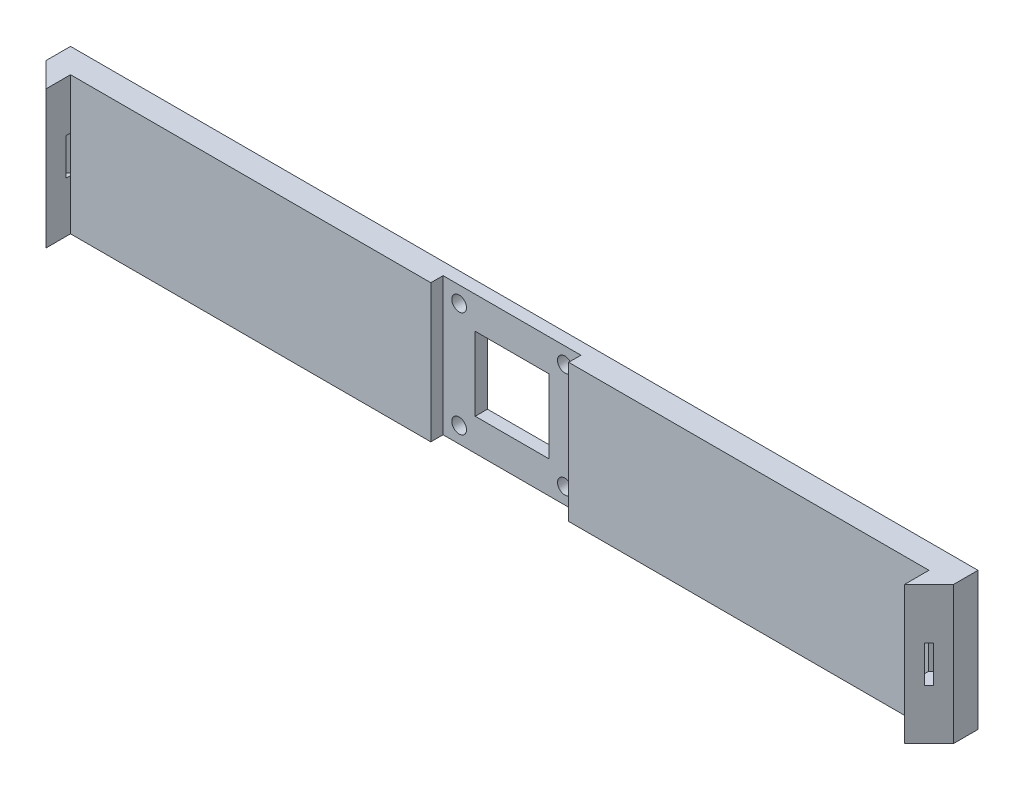
ISO-10303-21;
HEADER;
FILE_DESCRIPTION(('STEP AP214'),'2;1');
FILE_NAME('part.step','',(''),(''),'','','');
FILE_SCHEMA(('AUTOMOTIVE_DESIGN { 1 0 10303 214 1 1 1 1 }'));
ENDSEC;
DATA;
#1=APPLICATION_CONTEXT('core data for automotive mechanical design processes');
#2=APPLICATION_PROTOCOL_DEFINITION('international standard','automotive_design',2000,#1);
#3=PRODUCT_CONTEXT('',#1,'mechanical');
#4=PRODUCT('Part','Part','',(#3));
#5=PRODUCT_RELATED_PRODUCT_CATEGORY('part','',(#4));
#6=PRODUCT_DEFINITION_FORMATION('','',#4);
#7=PRODUCT_DEFINITION_CONTEXT('part definition',#1,'design');
#8=PRODUCT_DEFINITION('design','',#6,#7);
#9=PRODUCT_DEFINITION_SHAPE('','',#8);
#10=(LENGTH_UNIT() NAMED_UNIT(*) SI_UNIT(.MILLI.,.METRE.));
#11=(NAMED_UNIT(*) PLANE_ANGLE_UNIT() SI_UNIT($,.RADIAN.));
#12=(NAMED_UNIT(*) SI_UNIT($,.STERADIAN.) SOLID_ANGLE_UNIT());
#13=UNCERTAINTY_MEASURE_WITH_UNIT(LENGTH_MEASURE(1.E-05),#10,'distance_accuracy_value','');
#14=(GEOMETRIC_REPRESENTATION_CONTEXT(3) GLOBAL_UNCERTAINTY_ASSIGNED_CONTEXT((#13)) GLOBAL_UNIT_ASSIGNED_CONTEXT((#10,
#11,#12)) REPRESENTATION_CONTEXT('',''));
#15=CARTESIAN_POINT('',(0.,0.,0.));
#16=DIRECTION('',(0.,0.,1.));
#17=DIRECTION('',(1.,0.,0.));
#18=AXIS2_PLACEMENT_3D('',#15,#16,#17);
#19=CARTESIAN_POINT('',(0.,0.,10.));
#20=DIRECTION('',(0.,0.,-1.));
#21=DIRECTION('',(-1.,0.,0.));
#22=AXIS2_PLACEMENT_3D('',#19,#20,#21);
#23=PLANE('',#22);
#24=DIRECTION('',(0.,1.,0.));
#25=VECTOR('',#24,1.);
#26=CARTESIAN_POINT('',(-175.,-28.1,10.));
#27=LINE('',#26,#25);
#28=CARTESIAN_POINT('',(-175.,-28.1,10.));
#29=VERTEX_POINT('',#28);
#30=CARTESIAN_POINT('',(-175.,28.1,10.));
#31=VERTEX_POINT('',#30);
#32=EDGE_CURVE('E406',#29,#31,#27,.T.);
#33=ORIENTED_EDGE('',*,*,#32,.F.);
#34=DIRECTION('',(1.,0.,0.));
#35=VECTOR('',#34,1.);
#36=CARTESIAN_POINT('',(-175.,-28.1,10.));
#37=LINE('',#36,#35);
#38=CARTESIAN_POINT('',(-28.1,-28.1,10.));
#39=VERTEX_POINT('',#38);
#40=EDGE_CURVE('E508',#29,#39,#37,.T.);
#41=ORIENTED_EDGE('',*,*,#40,.T.);
#42=DIRECTION('',(0.,-1.,0.));
#43=VECTOR('',#42,1.);
#44=CARTESIAN_POINT('',(-28.1,-28.1,10.));
#45=LINE('',#44,#43);
#46=CARTESIAN_POINT('',(-28.1,28.1,10.));
#47=VERTEX_POINT('',#46);
#48=EDGE_CURVE('E470',#47,#39,#45,.T.);
#49=ORIENTED_EDGE('',*,*,#48,.F.);
#50=DIRECTION('',(-1.,0.,0.));
#51=VECTOR('',#50,1.);
#52=CARTESIAN_POINT('',(-175.,28.1,10.));
#53=LINE('',#52,#51);
#54=EDGE_CURVE('E507',#47,#31,#53,.T.);
#55=ORIENTED_EDGE('',*,*,#54,.T.);
#56=EDGE_LOOP('',(#33,#41,#49,#55));
#57=FACE_BOUND('',#56,.T.);
#58=ADVANCED_FACE('F39',(#57),#23,.F.);
#59=DIRECTION('',(0.,-1.,0.));
#60=VECTOR('',#59,1.);
#61=CARTESIAN_POINT('',(175.,28.1,10.));
#62=LINE('',#61,#60);
#63=CARTESIAN_POINT('',(175.,28.1,10.));
#64=VERTEX_POINT('',#63);
#65=CARTESIAN_POINT('',(175.,-28.1,10.));
#66=VERTEX_POINT('',#65);
#67=EDGE_CURVE('E440',#64,#66,#62,.T.);
#68=ORIENTED_EDGE('',*,*,#67,.F.);
#69=CARTESIAN_POINT('',(28.1,28.1,10.));
#70=VERTEX_POINT('',#69);
#71=EDGE_CURVE('E503',#64,#70,#53,.T.);
#72=ORIENTED_EDGE('',*,*,#71,.T.);
#73=DIRECTION('',(0.,1.,0.));
#74=VECTOR('',#73,1.);
#75=CARTESIAN_POINT('',(28.1,-28.1,10.));
#76=LINE('',#75,#74);
#77=CARTESIAN_POINT('',(28.1,-28.1,10.));
#78=VERTEX_POINT('',#77);
#79=EDGE_CURVE('E464',#78,#70,#76,.T.);
#80=ORIENTED_EDGE('',*,*,#79,.F.);
#81=EDGE_CURVE('E506',#78,#66,#37,.T.);
#82=ORIENTED_EDGE('',*,*,#81,.T.);
#83=EDGE_LOOP('',(#68,#72,#80,#82));
#84=FACE_BOUND('',#83,.T.);
#85=ADVANCED_FACE('F557',(#84),#23,.F.);
#86=CARTESIAN_POINT('',(-175.,28.1,10.));
#87=DIRECTION('',(0.,-1.,0.));
#88=DIRECTION('',(0.,0.,-1.));
#89=AXIS2_PLACEMENT_3D('',#86,#87,#88);
#90=PLANE('',#89);
#91=DIRECTION('',(0.,0.,-1.));
#92=VECTOR('',#91,1.);
#93=CARTESIAN_POINT('',(-185.,28.1,0.));
#94=LINE('',#93,#92);
#95=CARTESIAN_POINT('',(-185.,28.1,10.));
#96=VERTEX_POINT('',#95);
#97=CARTESIAN_POINT('',(-185.,28.1,0.));
#98=VERTEX_POINT('',#97);
#99=EDGE_CURVE('E427',#96,#98,#94,.T.);
#100=ORIENTED_EDGE('',*,*,#99,.F.);
#101=DIRECTION('',(-0.707106781186548,0.,-0.707106781186547));
#102=VECTOR('',#101,1.);
#103=CARTESIAN_POINT('',(-175.,28.1,20.));
#104=LINE('',#103,#102);
#105=CARTESIAN_POINT('',(-175.,28.1,20.));
#106=VERTEX_POINT('',#105);
#107=EDGE_CURVE('E386',#106,#96,#104,.T.);
#108=ORIENTED_EDGE('',*,*,#107,.F.);
#109=DIRECTION('',(0.,0.,-1.));
#110=VECTOR('',#109,1.);
#111=CARTESIAN_POINT('',(-175.,28.1,20.));
#112=LINE('',#111,#110);
#113=EDGE_CURVE('E410',#106,#31,#112,.T.);
#114=ORIENTED_EDGE('',*,*,#113,.T.);
#115=ORIENTED_EDGE('',*,*,#54,.F.);
#116=DIRECTION('',(0.,0.,1.));
#117=VECTOR('',#116,1.);
#118=CARTESIAN_POINT('',(-28.1,28.1,5.));
#119=LINE('',#118,#117);
#120=CARTESIAN_POINT('',(-28.1,28.1,5.));
#121=VERTEX_POINT('',#120);
#122=EDGE_CURVE('E497',#121,#47,#119,.T.);
#123=ORIENTED_EDGE('',*,*,#122,.F.);
#124=DIRECTION('',(-1.,0.,0.));
#125=VECTOR('',#124,1.);
#126=CARTESIAN_POINT('',(-28.1,28.1,5.));
#127=LINE('',#126,#125);
#128=CARTESIAN_POINT('',(28.1,28.1,5.));
#129=VERTEX_POINT('',#128);
#130=EDGE_CURVE('E469',#129,#121,#127,.T.);
#131=ORIENTED_EDGE('',*,*,#130,.F.);
#132=DIRECTION('',(0.,0.,1.));
#133=VECTOR('',#132,1.);
#134=CARTESIAN_POINT('',(28.1,28.1,5.));
#135=LINE('',#134,#133);
#136=EDGE_CURVE('E482',#129,#70,#135,.T.);
#137=ORIENTED_EDGE('',*,*,#136,.T.);
#138=ORIENTED_EDGE('',*,*,#71,.F.);
#139=DIRECTION('',(0.,0.,-1.));
#140=VECTOR('',#139,1.);
#141=CARTESIAN_POINT('',(175.,28.1,20.));
#142=LINE('',#141,#140);
#143=CARTESIAN_POINT('',(175.,28.1,20.));
#144=VERTEX_POINT('',#143);
#145=EDGE_CURVE('E450',#144,#64,#142,.T.);
#146=ORIENTED_EDGE('',*,*,#145,.F.);
#147=DIRECTION('',(-0.707106781186548,0.,0.707106781186547));
#148=VECTOR('',#147,1.);
#149=CARTESIAN_POINT('',(175.,28.1,20.));
#150=LINE('',#149,#148);
#151=CARTESIAN_POINT('',(185.,28.1,10.));
#152=VERTEX_POINT('',#151);
#153=EDGE_CURVE('E430',#152,#144,#150,.T.);
#154=ORIENTED_EDGE('',*,*,#153,.F.);
#155=DIRECTION('',(0.,0.,1.));
#156=VECTOR('',#155,1.);
#157=CARTESIAN_POINT('',(185.,28.1,10.));
#158=LINE('',#157,#156);
#159=CARTESIAN_POINT('',(185.,28.1,0.));
#160=VERTEX_POINT('',#159);
#161=EDGE_CURVE('E460',#160,#152,#158,.T.);
#162=ORIENTED_EDGE('',*,*,#161,.F.);
#163=DIRECTION('',(-1.,0.,0.));
#164=VECTOR('',#163,1.);
#165=CARTESIAN_POINT('',(-175.,28.1,0.));
#166=LINE('',#165,#164);
#167=EDGE_CURVE('E492',#160,#98,#166,.T.);
#168=ORIENTED_EDGE('',*,*,#167,.T.);
#169=EDGE_LOOP('',(#100,#108,#114,#115,#123,#131,#137,#138,#146,#154,#162,#168));
#170=FACE_BOUND('',#169,.T.);
#171=ADVANCED_FACE('F41',(#170),#90,.F.);
#172=CARTESIAN_POINT('',(-175.,-28.1,10.));
#173=DIRECTION('',(0.,1.,0.));
#174=DIRECTION('',(0.,0.,1.));
#175=AXIS2_PLACEMENT_3D('',#172,#173,#174);
#176=PLANE('',#175);
#177=DIRECTION('',(0.,0.,-1.));
#178=VECTOR('',#177,1.);
#179=CARTESIAN_POINT('',(-175.,-28.1,20.));
#180=LINE('',#179,#178);
#181=CARTESIAN_POINT('',(-175.,-28.1,20.));
#182=VERTEX_POINT('',#181);
#183=EDGE_CURVE('E416',#182,#29,#180,.T.);
#184=ORIENTED_EDGE('',*,*,#183,.F.);
#185=DIRECTION('',(-0.707106781186548,0.,-0.707106781186547));
#186=VECTOR('',#185,1.);
#187=CARTESIAN_POINT('',(-175.,-28.1,20.));
#188=LINE('',#187,#186);
#189=CARTESIAN_POINT('',(-185.,-28.1,10.));
#190=VERTEX_POINT('',#189);
#191=EDGE_CURVE('E396',#182,#190,#188,.T.);
#192=ORIENTED_EDGE('',*,*,#191,.T.);
#193=DIRECTION('',(0.,0.,1.));
#194=VECTOR('',#193,1.);
#195=CARTESIAN_POINT('',(-185.,-28.1,0.));
#196=LINE('',#195,#194);
#197=CARTESIAN_POINT('',(-185.,-28.1,0.));
#198=VERTEX_POINT('',#197);
#199=EDGE_CURVE('E423',#198,#190,#196,.T.);
#200=ORIENTED_EDGE('',*,*,#199,.F.);
#201=DIRECTION('',(1.,0.,0.));
#202=VECTOR('',#201,1.);
#203=CARTESIAN_POINT('',(-175.,-28.1,0.));
#204=LINE('',#203,#202);
#205=CARTESIAN_POINT('',(185.,-28.1,0.));
#206=VERTEX_POINT('',#205);
#207=EDGE_CURVE('E514',#198,#206,#204,.T.);
#208=ORIENTED_EDGE('',*,*,#207,.T.);
#209=DIRECTION('',(0.,0.,-1.));
#210=VECTOR('',#209,1.);
#211=CARTESIAN_POINT('',(185.,-28.1,10.));
#212=LINE('',#211,#210);
#213=CARTESIAN_POINT('',(185.,-28.1,10.));
#214=VERTEX_POINT('',#213);
#215=EDGE_CURVE('E453',#214,#206,#212,.T.);
#216=ORIENTED_EDGE('',*,*,#215,.F.);
#217=DIRECTION('',(-0.707106781186548,0.,0.707106781186547));
#218=VECTOR('',#217,1.);
#219=CARTESIAN_POINT('',(175.,-28.1,20.));
#220=LINE('',#219,#218);
#221=CARTESIAN_POINT('',(175.,-28.1,20.));
#222=VERTEX_POINT('',#221);
#223=EDGE_CURVE('E431',#214,#222,#220,.T.);
#224=ORIENTED_EDGE('',*,*,#223,.T.);
#225=DIRECTION('',(0.,0.,-1.));
#226=VECTOR('',#225,1.);
#227=CARTESIAN_POINT('',(175.,-28.1,20.));
#228=LINE('',#227,#226);
#229=EDGE_CURVE('E444',#222,#66,#228,.T.);
#230=ORIENTED_EDGE('',*,*,#229,.T.);
#231=ORIENTED_EDGE('',*,*,#81,.F.);
#232=DIRECTION('',(0.,0.,1.));
#233=VECTOR('',#232,1.);
#234=CARTESIAN_POINT('',(28.1,-28.1,5.));
#235=LINE('',#234,#233);
#236=CARTESIAN_POINT('',(28.1,-28.1,5.));
#237=VERTEX_POINT('',#236);
#238=EDGE_CURVE('E489',#237,#78,#235,.T.);
#239=ORIENTED_EDGE('',*,*,#238,.F.);
#240=DIRECTION('',(1.,0.,0.));
#241=VECTOR('',#240,1.);
#242=CARTESIAN_POINT('',(-28.1,-28.1,5.));
#243=LINE('',#242,#241);
#244=CARTESIAN_POINT('',(-28.1,-28.1,5.));
#245=VERTEX_POINT('',#244);
#246=EDGE_CURVE('E478',#245,#237,#243,.T.);
#247=ORIENTED_EDGE('',*,*,#246,.F.);
#248=DIRECTION('',(0.,0.,1.));
#249=VECTOR('',#248,1.);
#250=CARTESIAN_POINT('',(-28.1,-28.1,5.));
#251=LINE('',#250,#249);
#252=EDGE_CURVE('E493',#245,#39,#251,.T.);
#253=ORIENTED_EDGE('',*,*,#252,.T.);
#254=ORIENTED_EDGE('',*,*,#40,.F.);
#255=EDGE_LOOP('',(#184,#192,#200,#208,#216,#224,#230,#231,#239,#247,#253,#254));
#256=FACE_BOUND('',#255,.T.);
#257=ADVANCED_FACE('F571',(#256),#176,.F.);
#258=CARTESIAN_POINT('',(0.,0.,0.));
#259=DIRECTION('',(0.,0.,-1.));
#260=DIRECTION('',(-1.,0.,0.));
#261=AXIS2_PLACEMENT_3D('',#258,#259,#260);
#262=PLANE('',#261);
#263=CARTESIAN_POINT('',(21.55,-21.55,0.));
#264=DIRECTION('',(0.,0.,1.));
#265=DIRECTION('',(1.,0.,0.));
#266=AXIS2_PLACEMENT_3D('',#263,#264,#265);
#267=CIRCLE('',#266,3.);
#268=CARTESIAN_POINT('',(24.55,-21.55,0.));
#269=VERTEX_POINT('',#268);
#270=EDGE_CURVE('E337',#269,#269,#267,.T.);
#271=ORIENTED_EDGE('',*,*,#270,.T.);
#272=EDGE_LOOP('',(#271));
#273=FACE_BOUND('',#272,.T.);
#274=CARTESIAN_POINT('',(-21.55,21.55,0.));
#275=DIRECTION('',(0.,0.,1.));
#276=DIRECTION('',(1.,0.,0.));
#277=AXIS2_PLACEMENT_3D('',#274,#275,#276);
#278=CIRCLE('',#277,3.);
#279=CARTESIAN_POINT('',(-18.55,21.55,0.));
#280=VERTEX_POINT('',#279);
#281=EDGE_CURVE('E329',#280,#280,#278,.T.);
#282=ORIENTED_EDGE('',*,*,#281,.T.);
#283=EDGE_LOOP('',(#282));
#284=FACE_BOUND('',#283,.T.);
#285=CARTESIAN_POINT('',(-21.55,-21.55,0.));
#286=DIRECTION('',(0.,0.,1.));
#287=DIRECTION('',(1.,0.,0.));
#288=AXIS2_PLACEMENT_3D('',#285,#286,#287);
#289=CIRCLE('',#288,3.);
#290=CARTESIAN_POINT('',(-18.55,-21.55,0.));
#291=VERTEX_POINT('',#290);
#292=EDGE_CURVE('E320',#291,#291,#289,.T.);
#293=ORIENTED_EDGE('',*,*,#292,.T.);
#294=EDGE_LOOP('',(#293));
#295=FACE_BOUND('',#294,.T.);
#296=CARTESIAN_POINT('',(21.55,21.55,0.));
#297=DIRECTION('',(0.,0.,1.));
#298=DIRECTION('',(1.,0.,0.));
#299=AXIS2_PLACEMENT_3D('',#296,#297,#298);
#300=CIRCLE('',#299,3.);
#301=CARTESIAN_POINT('',(24.55,21.55,0.));
#302=VERTEX_POINT('',#301);
#303=EDGE_CURVE('E344',#302,#302,#300,.T.);
#304=ORIENTED_EDGE('',*,*,#303,.T.);
#305=EDGE_LOOP('',(#304));
#306=FACE_BOUND('',#305,.T.);
#307=DIRECTION('',(0.,1.,0.));
#308=VECTOR('',#307,1.);
#309=CARTESIAN_POINT('',(15.,-15.,0.));
#310=LINE('',#309,#308);
#311=CARTESIAN_POINT('',(15.,-15.,0.));
#312=VERTEX_POINT('',#311);
#313=CARTESIAN_POINT('',(15.,15.,0.));
#314=VERTEX_POINT('',#313);
#315=EDGE_CURVE('E352',#312,#314,#310,.T.);
#316=ORIENTED_EDGE('',*,*,#315,.T.);
#317=DIRECTION('',(-1.,0.,0.));
#318=VECTOR('',#317,1.);
#319=CARTESIAN_POINT('',(-15.,15.,0.));
#320=LINE('',#319,#318);
#321=CARTESIAN_POINT('',(-15.,15.,0.));
#322=VERTEX_POINT('',#321);
#323=EDGE_CURVE('E356',#314,#322,#320,.T.);
#324=ORIENTED_EDGE('',*,*,#323,.T.);
#325=DIRECTION('',(0.,-1.,0.));
#326=VECTOR('',#325,1.);
#327=CARTESIAN_POINT('',(-15.,-15.,0.));
#328=LINE('',#327,#326);
#329=CARTESIAN_POINT('',(-15.,-15.,0.));
#330=VERTEX_POINT('',#329);
#331=EDGE_CURVE('E361',#322,#330,#328,.T.);
#332=ORIENTED_EDGE('',*,*,#331,.T.);
#333=DIRECTION('',(1.,0.,0.));
#334=VECTOR('',#333,1.);
#335=CARTESIAN_POINT('',(-15.,-15.,0.));
#336=LINE('',#335,#334);
#337=EDGE_CURVE('E365',#330,#312,#336,.T.);
#338=ORIENTED_EDGE('',*,*,#337,.T.);
#339=EDGE_LOOP('',(#316,#324,#332,#338));
#340=FACE_BOUND('',#339,.T.);
#341=ORIENTED_EDGE('',*,*,#167,.F.);
#342=DIRECTION('',(0.,1.,0.));
#343=VECTOR('',#342,1.);
#344=CARTESIAN_POINT('',(185.,28.1,0.));
#345=LINE('',#344,#343);
#346=EDGE_CURVE('E456',#206,#160,#345,.T.);
#347=ORIENTED_EDGE('',*,*,#346,.F.);
#348=ORIENTED_EDGE('',*,*,#207,.F.);
#349=DIRECTION('',(0.,-1.,0.));
#350=VECTOR('',#349,1.);
#351=CARTESIAN_POINT('',(-185.,-28.1,0.));
#352=LINE('',#351,#350);
#353=EDGE_CURVE('E419',#98,#198,#352,.T.);
#354=ORIENTED_EDGE('',*,*,#353,.F.);
#355=EDGE_LOOP('',(#341,#347,#348,#354));
#356=FACE_BOUND('',#355,.T.);
#357=ADVANCED_FACE('F569',(#273,#284,#295,#306,#340,#356),#262,.T.);
#358=CARTESIAN_POINT('',(28.1,-28.1,5.));
#359=DIRECTION('',(1.,0.,0.));
#360=DIRECTION('',(0.,0.,-1.));
#361=AXIS2_PLACEMENT_3D('',#358,#359,#360);
#362=PLANE('',#361);
#363=ORIENTED_EDGE('',*,*,#79,.T.);
#364=ORIENTED_EDGE('',*,*,#136,.F.);
#365=DIRECTION('',(0.,1.,0.));
#366=VECTOR('',#365,1.);
#367=CARTESIAN_POINT('',(28.1,-28.1,5.));
#368=LINE('',#367,#366);
#369=EDGE_CURVE('E465',#237,#129,#368,.T.);
#370=ORIENTED_EDGE('',*,*,#369,.F.);
#371=ORIENTED_EDGE('',*,*,#238,.T.);
#372=EDGE_LOOP('',(#363,#364,#370,#371));
#373=FACE_BOUND('',#372,.T.);
#374=ADVANCED_FACE('F567',(#373),#362,.F.);
#375=CARTESIAN_POINT('',(-28.1,-28.1,5.));
#376=DIRECTION('',(-1.,0.,0.));
#377=DIRECTION('',(0.,0.,1.));
#378=AXIS2_PLACEMENT_3D('',#375,#376,#377);
#379=PLANE('',#378);
#380=ORIENTED_EDGE('',*,*,#48,.T.);
#381=ORIENTED_EDGE('',*,*,#252,.F.);
#382=DIRECTION('',(0.,-1.,0.));
#383=VECTOR('',#382,1.);
#384=CARTESIAN_POINT('',(-28.1,-28.1,5.));
#385=LINE('',#384,#383);
#386=EDGE_CURVE('E474',#121,#245,#385,.T.);
#387=ORIENTED_EDGE('',*,*,#386,.F.);
#388=ORIENTED_EDGE('',*,*,#122,.T.);
#389=EDGE_LOOP('',(#380,#381,#387,#388));
#390=FACE_BOUND('',#389,.T.);
#391=ADVANCED_FACE('F622',(#390),#379,.F.);
#392=CARTESIAN_POINT('',(0.,0.,5.));
#393=DIRECTION('',(0.,0.,-1.));
#394=DIRECTION('',(-1.,0.,0.));
#395=AXIS2_PLACEMENT_3D('',#392,#393,#394);
#396=PLANE('',#395);
#397=CARTESIAN_POINT('',(21.55,-21.55,5.));
#398=DIRECTION('',(0.,0.,1.));
#399=DIRECTION('',(1.,0.,0.));
#400=AXIS2_PLACEMENT_3D('',#397,#398,#399);
#401=CIRCLE('',#400,3.);
#402=CARTESIAN_POINT('',(24.55,-21.55,5.));
#403=VERTEX_POINT('',#402);
#404=EDGE_CURVE('E319',#403,#403,#401,.T.);
#405=ORIENTED_EDGE('',*,*,#404,.F.);
#406=EDGE_LOOP('',(#405));
#407=FACE_BOUND('',#406,.T.);
#408=CARTESIAN_POINT('',(-21.55,21.55,5.));
#409=DIRECTION('',(0.,0.,1.));
#410=DIRECTION('',(1.,0.,0.));
#411=AXIS2_PLACEMENT_3D('',#408,#409,#410);
#412=CIRCLE('',#411,3.);
#413=CARTESIAN_POINT('',(-18.55,21.55,5.));
#414=VERTEX_POINT('',#413);
#415=EDGE_CURVE('E333',#414,#414,#412,.T.);
#416=ORIENTED_EDGE('',*,*,#415,.F.);
#417=EDGE_LOOP('',(#416));
#418=FACE_BOUND('',#417,.T.);
#419=CARTESIAN_POINT('',(-21.55,-21.55,5.));
#420=DIRECTION('',(0.,0.,1.));
#421=DIRECTION('',(1.,0.,0.));
#422=AXIS2_PLACEMENT_3D('',#419,#420,#421);
#423=CIRCLE('',#422,3.);
#424=CARTESIAN_POINT('',(-18.55,-21.55,5.));
#425=VERTEX_POINT('',#424);
#426=EDGE_CURVE('E325',#425,#425,#423,.T.);
#427=ORIENTED_EDGE('',*,*,#426,.F.);
#428=EDGE_LOOP('',(#427));
#429=FACE_BOUND('',#428,.T.);
#430=CARTESIAN_POINT('',(21.55,21.55,5.));
#431=DIRECTION('',(0.,0.,1.));
#432=DIRECTION('',(1.,0.,0.));
#433=AXIS2_PLACEMENT_3D('',#430,#431,#432);
#434=CIRCLE('',#433,3.);
#435=CARTESIAN_POINT('',(24.55,21.55,5.));
#436=VERTEX_POINT('',#435);
#437=EDGE_CURVE('E324',#436,#436,#434,.T.);
#438=ORIENTED_EDGE('',*,*,#437,.F.);
#439=EDGE_LOOP('',(#438));
#440=FACE_BOUND('',#439,.T.);
#441=DIRECTION('',(-1.,0.,0.));
#442=VECTOR('',#441,1.);
#443=CARTESIAN_POINT('',(-15.,15.,5.));
#444=LINE('',#443,#442);
#445=CARTESIAN_POINT('',(15.,15.,5.));
#446=VERTEX_POINT('',#445);
#447=CARTESIAN_POINT('',(-15.,15.,5.));
#448=VERTEX_POINT('',#447);
#449=EDGE_CURVE('E372',#446,#448,#444,.T.);
#450=ORIENTED_EDGE('',*,*,#449,.F.);
#451=DIRECTION('',(0.,1.,0.));
#452=VECTOR('',#451,1.);
#453=CARTESIAN_POINT('',(15.,-15.,5.));
#454=LINE('',#453,#452);
#455=CARTESIAN_POINT('',(15.,-15.,5.));
#456=VERTEX_POINT('',#455);
#457=EDGE_CURVE('E348',#456,#446,#454,.T.);
#458=ORIENTED_EDGE('',*,*,#457,.F.);
#459=DIRECTION('',(1.,0.,0.));
#460=VECTOR('',#459,1.);
#461=CARTESIAN_POINT('',(-15.,-15.,5.));
#462=LINE('',#461,#460);
#463=CARTESIAN_POINT('',(-15.,-15.,5.));
#464=VERTEX_POINT('',#463);
#465=EDGE_CURVE('E357',#464,#456,#462,.T.);
#466=ORIENTED_EDGE('',*,*,#465,.F.);
#467=DIRECTION('',(0.,-1.,0.));
#468=VECTOR('',#467,1.);
#469=CARTESIAN_POINT('',(-15.,-15.,5.));
#470=LINE('',#469,#468);
#471=EDGE_CURVE('E376',#448,#464,#470,.T.);
#472=ORIENTED_EDGE('',*,*,#471,.F.);
#473=EDGE_LOOP('',(#450,#458,#466,#472));
#474=FACE_BOUND('',#473,.T.);
#475=ORIENTED_EDGE('',*,*,#369,.T.);
#476=ORIENTED_EDGE('',*,*,#130,.T.);
#477=ORIENTED_EDGE('',*,*,#386,.T.);
#478=ORIENTED_EDGE('',*,*,#246,.T.);
#479=EDGE_LOOP('',(#475,#476,#477,#478));
#480=FACE_BOUND('',#479,.T.);
#481=ADVANCED_FACE('F615',(#407,#418,#429,#440,#474,#480),#396,.F.);
#482=CARTESIAN_POINT('',(185.,0.,0.));
#483=DIRECTION('',(1.,0.,0.));
#484=DIRECTION('',(0.,0.,-1.));
#485=AXIS2_PLACEMENT_3D('',#482,#483,#484);
#486=PLANE('',#485);
#487=DIRECTION('',(0.,1.,0.));
#488=VECTOR('',#487,1.);
#489=CARTESIAN_POINT('',(185.,-28.1,10.));
#490=LINE('',#489,#488);
#491=EDGE_CURVE('E435',#214,#152,#490,.T.);
#492=ORIENTED_EDGE('',*,*,#491,.F.);
#493=ORIENTED_EDGE('',*,*,#215,.T.);
#494=ORIENTED_EDGE('',*,*,#346,.T.);
#495=ORIENTED_EDGE('',*,*,#161,.T.);
#496=EDGE_LOOP('',(#492,#493,#494,#495));
#497=FACE_BOUND('',#496,.T.);
#498=ADVANCED_FACE('F601',(#497),#486,.T.);
#499=CARTESIAN_POINT('',(175.,28.1,20.));
#500=DIRECTION('',(1.,0.,0.));
#501=DIRECTION('',(0.,0.,-1.));
#502=AXIS2_PLACEMENT_3D('',#499,#500,#501);
#503=PLANE('',#502);
#504=DIRECTION('',(0.,0.,1.));
#505=VECTOR('',#504,1.);
#506=CARTESIAN_POINT('',(175.,7.5,20.));
#507=LINE('',#506,#505);
#508=CARTESIAN_POINT('',(175.,7.5,10.1005050633884));
#509=VERTEX_POINT('',#508);
#510=CARTESIAN_POINT('',(175.,7.5,11.7677669529664));
#511=VERTEX_POINT('',#510);
#512=EDGE_CURVE('E311',#509,#511,#507,.T.);
#513=ORIENTED_EDGE('',*,*,#512,.T.);
#514=DIRECTION('',(0.,-1.,0.));
#515=VECTOR('',#514,1.);
#516=CARTESIAN_POINT('',(175.,28.1,11.7677669529664));
#517=LINE('',#516,#515);
#518=CARTESIAN_POINT('',(175.,-7.5,11.7677669529664));
#519=VERTEX_POINT('',#518);
#520=EDGE_CURVE('E315',#511,#519,#517,.T.);
#521=ORIENTED_EDGE('',*,*,#520,.T.);
#522=DIRECTION('',(0.,0.,-1.));
#523=VECTOR('',#522,1.);
#524=CARTESIAN_POINT('',(175.,-7.5,20.));
#525=LINE('',#524,#523);
#526=CARTESIAN_POINT('',(175.,-7.5,10.1005050633884));
#527=VERTEX_POINT('',#526);
#528=EDGE_CURVE('E298',#519,#527,#525,.T.);
#529=ORIENTED_EDGE('',*,*,#528,.T.);
#530=DIRECTION('',(0.,-1.,0.));
#531=VECTOR('',#530,1.);
#532=CARTESIAN_POINT('',(175.,28.1,10.1005050633884));
#533=LINE('',#532,#531);
#534=EDGE_CURVE('E48',#509,#527,#533,.T.);
#535=ORIENTED_EDGE('',*,*,#534,.F.);
#536=EDGE_LOOP('',(#513,#521,#529,#535));
#537=FACE_BOUND('',#536,.T.);
#538=ORIENTED_EDGE('',*,*,#67,.T.);
#539=ORIENTED_EDGE('',*,*,#229,.F.);
#540=DIRECTION('',(0.,-1.,0.));
#541=VECTOR('',#540,1.);
#542=CARTESIAN_POINT('',(175.,28.1,20.));
#543=LINE('',#542,#541);
#544=EDGE_CURVE('E441',#144,#222,#543,.T.);
#545=ORIENTED_EDGE('',*,*,#544,.F.);
#546=ORIENTED_EDGE('',*,*,#145,.T.);
#547=EDGE_LOOP('',(#538,#539,#545,#546));
#548=FACE_BOUND('',#547,.T.);
#549=ADVANCED_FACE('F530',(#537,#548),#503,.F.);
#550=CARTESIAN_POINT('',(175.,-28.1,20.));
#551=DIRECTION('',(-0.707106781186547,0.,-0.707106781186548));
#552=DIRECTION('',(-0.707106781186548,0.,0.707106781186547));
#553=AXIS2_PLACEMENT_3D('',#550,#551,#552);
#554=PLANE('',#553);
#555=DIRECTION('',(0.70710678118655,0.,-0.707106781186545));
#556=VECTOR('',#555,1.);
#557=CARTESIAN_POINT('',(180.883883476483,-7.5,14.1161165235168));
#558=LINE('',#557,#556);
#559=CARTESIAN_POINT('',(179.116116523517,-7.5,15.8838834764832));
#560=VERTEX_POINT('',#559);
#561=CARTESIAN_POINT('',(180.883883476483,-7.5,14.1161165235168));
#562=VERTEX_POINT('',#561);
#563=EDGE_CURVE('E284',#560,#562,#558,.T.);
#564=ORIENTED_EDGE('',*,*,#563,.F.);
#565=DIRECTION('',(0.,-1.,0.));
#566=VECTOR('',#565,1.);
#567=CARTESIAN_POINT('',(179.116116523517,-7.5,15.8838834764832));
#568=LINE('',#567,#566);
#569=CARTESIAN_POINT('',(179.116116523517,7.5,15.8838834764832));
#570=VERTEX_POINT('',#569);
#571=EDGE_CURVE('E269',#570,#560,#568,.T.);
#572=ORIENTED_EDGE('',*,*,#571,.F.);
#573=DIRECTION('',(-0.70710678118655,0.,0.707106781186545));
#574=VECTOR('',#573,1.);
#575=CARTESIAN_POINT('',(180.883883476483,7.5,14.1161165235168));
#576=LINE('',#575,#574);
#577=CARTESIAN_POINT('',(180.883883476483,7.5,14.1161165235168));
#578=VERTEX_POINT('',#577);
#579=EDGE_CURVE('E274',#578,#570,#576,.T.);
#580=ORIENTED_EDGE('',*,*,#579,.F.);
#581=DIRECTION('',(0.,1.,0.));
#582=VECTOR('',#581,1.);
#583=CARTESIAN_POINT('',(180.883883476483,-7.5,14.1161165235168));
#584=LINE('',#583,#582);
#585=EDGE_CURVE('E288',#562,#578,#584,.T.);
#586=ORIENTED_EDGE('',*,*,#585,.F.);
#587=EDGE_LOOP('',(#564,#572,#580,#586));
#588=FACE_BOUND('',#587,.T.);
#589=ORIENTED_EDGE('',*,*,#153,.T.);
#590=ORIENTED_EDGE('',*,*,#544,.T.);
#591=ORIENTED_EDGE('',*,*,#223,.F.);
#592=ORIENTED_EDGE('',*,*,#491,.T.);
#593=EDGE_LOOP('',(#589,#590,#591,#592));
#594=FACE_BOUND('',#593,.T.);
#595=ADVANCED_FACE('F542',(#588,#594),#554,.F.);
#596=CARTESIAN_POINT('',(-185.,0.,0.));
#597=DIRECTION('',(1.,0.,0.));
#598=DIRECTION('',(0.,0.,-1.));
#599=AXIS2_PLACEMENT_3D('',#596,#597,#598);
#600=PLANE('',#599);
#601=ORIENTED_EDGE('',*,*,#199,.T.);
#602=DIRECTION('',(0.,1.,0.));
#603=VECTOR('',#602,1.);
#604=CARTESIAN_POINT('',(-185.,-28.1,10.));
#605=LINE('',#604,#603);
#606=EDGE_CURVE('E400',#190,#96,#605,.T.);
#607=ORIENTED_EDGE('',*,*,#606,.T.);
#608=ORIENTED_EDGE('',*,*,#99,.T.);
#609=ORIENTED_EDGE('',*,*,#353,.T.);
#610=EDGE_LOOP('',(#601,#607,#608,#609));
#611=FACE_BOUND('',#610,.T.);
#612=ADVANCED_FACE('F595',(#611),#600,.F.);
#613=CARTESIAN_POINT('',(-175.,-28.1,20.));
#614=DIRECTION('',(-1.,0.,0.));
#615=DIRECTION('',(0.,0.,1.));
#616=AXIS2_PLACEMENT_3D('',#613,#614,#615);
#617=PLANE('',#616);
#618=DIRECTION('',(0.,0.,1.));
#619=VECTOR('',#618,1.);
#620=CARTESIAN_POINT('',(-175.,-7.5,20.));
#621=LINE('',#620,#619);
#622=CARTESIAN_POINT('',(-175.,-7.5,10.1005050633884));
#623=VERTEX_POINT('',#622);
#624=CARTESIAN_POINT('',(-175.,-7.5,11.7677669529664));
#625=VERTEX_POINT('',#624);
#626=EDGE_CURVE('E261',#623,#625,#621,.T.);
#627=ORIENTED_EDGE('',*,*,#626,.T.);
#628=DIRECTION('',(0.,1.,0.));
#629=VECTOR('',#628,1.);
#630=CARTESIAN_POINT('',(-175.,-28.1,11.7677669529664));
#631=LINE('',#630,#629);
#632=CARTESIAN_POINT('',(-175.,7.5,11.7677669529664));
#633=VERTEX_POINT('',#632);
#634=EDGE_CURVE('E265',#625,#633,#631,.T.);
#635=ORIENTED_EDGE('',*,*,#634,.T.);
#636=DIRECTION('',(0.,0.,-1.));
#637=VECTOR('',#636,1.);
#638=CARTESIAN_POINT('',(-175.,7.5,20.));
#639=LINE('',#638,#637);
#640=CARTESIAN_POINT('',(-175.,7.5,10.1005050633884));
#641=VERTEX_POINT('',#640);
#642=EDGE_CURVE('E254',#633,#641,#639,.T.);
#643=ORIENTED_EDGE('',*,*,#642,.T.);
#644=DIRECTION('',(0.,1.,0.));
#645=VECTOR('',#644,1.);
#646=CARTESIAN_POINT('',(-175.,-28.1,10.1005050633884));
#647=LINE('',#646,#645);
#648=EDGE_CURVE('E11',#623,#641,#647,.T.);
#649=ORIENTED_EDGE('',*,*,#648,.F.);
#650=EDGE_LOOP('',(#627,#635,#643,#649));
#651=FACE_BOUND('',#650,.T.);
#652=ORIENTED_EDGE('',*,*,#32,.T.);
#653=ORIENTED_EDGE('',*,*,#113,.F.);
#654=DIRECTION('',(0.,1.,0.));
#655=VECTOR('',#654,1.);
#656=CARTESIAN_POINT('',(-175.,-28.1,20.));
#657=LINE('',#656,#655);
#658=EDGE_CURVE('E407',#182,#106,#657,.T.);
#659=ORIENTED_EDGE('',*,*,#658,.F.);
#660=ORIENTED_EDGE('',*,*,#183,.T.);
#661=EDGE_LOOP('',(#652,#653,#659,#660));
#662=FACE_BOUND('',#661,.T.);
#663=ADVANCED_FACE('F585',(#651,#662),#617,.F.);
#664=CARTESIAN_POINT('',(-175.,-28.1,20.));
#665=DIRECTION('',(0.707106781186547,0.,-0.707106781186548));
#666=DIRECTION('',(-0.707106781186548,0.,-0.707106781186547));
#667=AXIS2_PLACEMENT_3D('',#664,#665,#666);
#668=PLANE('',#667);
#669=DIRECTION('',(-0.70710678118655,0.,-0.707106781186545));
#670=VECTOR('',#669,1.);
#671=CARTESIAN_POINT('',(-180.883883476483,7.5,14.1161165235168));
#672=LINE('',#671,#670);
#673=CARTESIAN_POINT('',(-179.116116523517,7.5,15.8838834764832));
#674=VERTEX_POINT('',#673);
#675=CARTESIAN_POINT('',(-180.883883476483,7.5,14.1161165235168));
#676=VERTEX_POINT('',#675);
#677=EDGE_CURVE('E227',#674,#676,#672,.T.);
#678=ORIENTED_EDGE('',*,*,#677,.F.);
#679=DIRECTION('',(0.,1.,0.));
#680=VECTOR('',#679,1.);
#681=CARTESIAN_POINT('',(-179.116116523517,7.5,15.8838834764832));
#682=LINE('',#681,#680);
#683=CARTESIAN_POINT('',(-179.116116523517,-7.5,15.8838834764832));
#684=VERTEX_POINT('',#683);
#685=EDGE_CURVE('E62',#684,#674,#682,.T.);
#686=ORIENTED_EDGE('',*,*,#685,.F.);
#687=DIRECTION('',(0.70710678118655,0.,0.707106781186545));
#688=VECTOR('',#687,1.);
#689=CARTESIAN_POINT('',(-180.883883476483,-7.5,14.1161165235168));
#690=LINE('',#689,#688);
#691=CARTESIAN_POINT('',(-180.883883476483,-7.5,14.1161165235168));
#692=VERTEX_POINT('',#691);
#693=EDGE_CURVE('E221',#692,#684,#690,.T.);
#694=ORIENTED_EDGE('',*,*,#693,.F.);
#695=DIRECTION('',(0.,-1.,0.));
#696=VECTOR('',#695,1.);
#697=CARTESIAN_POINT('',(-180.883883476483,7.5,14.1161165235168));
#698=LINE('',#697,#696);
#699=EDGE_CURVE('E245',#676,#692,#698,.T.);
#700=ORIENTED_EDGE('',*,*,#699,.F.);
#701=EDGE_LOOP('',(#678,#686,#694,#700));
#702=FACE_BOUND('',#701,.T.);
#703=ORIENTED_EDGE('',*,*,#107,.T.);
#704=ORIENTED_EDGE('',*,*,#606,.F.);
#705=ORIENTED_EDGE('',*,*,#191,.F.);
#706=ORIENTED_EDGE('',*,*,#658,.T.);
#707=EDGE_LOOP('',(#703,#704,#705,#706));
#708=FACE_BOUND('',#707,.T.);
#709=ADVANCED_FACE('F588',(#702,#708),#668,.F.);
#710=CARTESIAN_POINT('',(15.,-15.,0.));
#711=DIRECTION('',(1.,0.,0.));
#712=DIRECTION('',(0.,0.,-1.));
#713=AXIS2_PLACEMENT_3D('',#710,#711,#712);
#714=PLANE('',#713);
#715=ORIENTED_EDGE('',*,*,#457,.T.);
#716=DIRECTION('',(0.,0.,1.));
#717=VECTOR('',#716,1.);
#718=CARTESIAN_POINT('',(15.,15.,0.));
#719=LINE('',#718,#717);
#720=EDGE_CURVE('E369',#314,#446,#719,.T.);
#721=ORIENTED_EDGE('',*,*,#720,.F.);
#722=ORIENTED_EDGE('',*,*,#315,.F.);
#723=DIRECTION('',(0.,0.,1.));
#724=VECTOR('',#723,1.);
#725=CARTESIAN_POINT('',(15.,-15.,0.));
#726=LINE('',#725,#724);
#727=EDGE_CURVE('E383',#312,#456,#726,.T.);
#728=ORIENTED_EDGE('',*,*,#727,.T.);
#729=EDGE_LOOP('',(#715,#721,#722,#728));
#730=FACE_BOUND('',#729,.T.);
#731=ADVANCED_FACE('F644',(#730),#714,.F.);
#732=CARTESIAN_POINT('',(-15.,-15.,0.));
#733=DIRECTION('',(0.,-1.,0.));
#734=DIRECTION('',(0.,0.,-1.));
#735=AXIS2_PLACEMENT_3D('',#732,#733,#734);
#736=PLANE('',#735);
#737=ORIENTED_EDGE('',*,*,#465,.T.);
#738=ORIENTED_EDGE('',*,*,#727,.F.);
#739=ORIENTED_EDGE('',*,*,#337,.F.);
#740=DIRECTION('',(0.,0.,1.));
#741=VECTOR('',#740,1.);
#742=CARTESIAN_POINT('',(-15.,-15.,0.));
#743=LINE('',#742,#741);
#744=EDGE_CURVE('E387',#330,#464,#743,.T.);
#745=ORIENTED_EDGE('',*,*,#744,.T.);
#746=EDGE_LOOP('',(#737,#738,#739,#745));
#747=FACE_BOUND('',#746,.T.);
#748=ADVANCED_FACE('F648',(#747),#736,.F.);
#749=CARTESIAN_POINT('',(-15.,-15.,0.));
#750=DIRECTION('',(-1.,0.,0.));
#751=DIRECTION('',(0.,0.,1.));
#752=AXIS2_PLACEMENT_3D('',#749,#750,#751);
#753=PLANE('',#752);
#754=ORIENTED_EDGE('',*,*,#471,.T.);
#755=ORIENTED_EDGE('',*,*,#744,.F.);
#756=ORIENTED_EDGE('',*,*,#331,.F.);
#757=DIRECTION('',(0.,0.,1.));
#758=VECTOR('',#757,1.);
#759=CARTESIAN_POINT('',(-15.,15.,0.));
#760=LINE('',#759,#758);
#761=EDGE_CURVE('E390',#322,#448,#760,.T.);
#762=ORIENTED_EDGE('',*,*,#761,.T.);
#763=EDGE_LOOP('',(#754,#755,#756,#762));
#764=FACE_BOUND('',#763,.T.);
#765=ADVANCED_FACE('F654',(#764),#753,.F.);
#766=CARTESIAN_POINT('',(-15.,15.,0.));
#767=DIRECTION('',(0.,1.,0.));
#768=DIRECTION('',(0.,0.,1.));
#769=AXIS2_PLACEMENT_3D('',#766,#767,#768);
#770=PLANE('',#769);
#771=ORIENTED_EDGE('',*,*,#449,.T.);
#772=ORIENTED_EDGE('',*,*,#761,.F.);
#773=ORIENTED_EDGE('',*,*,#323,.F.);
#774=ORIENTED_EDGE('',*,*,#720,.T.);
#775=EDGE_LOOP('',(#771,#772,#773,#774));
#776=FACE_BOUND('',#775,.T.);
#777=ADVANCED_FACE('F650',(#776),#770,.F.);
#778=CARTESIAN_POINT('',(21.55,21.55,0.));
#779=DIRECTION('',(0.,0.,1.));
#780=DIRECTION('',(1.,0.,0.));
#781=AXIS2_PLACEMENT_3D('',#778,#779,#780);
#782=CYLINDRICAL_SURFACE('',#781,3.);
#783=ORIENTED_EDGE('',*,*,#303,.F.);
#784=EDGE_LOOP('',(#783));
#785=FACE_BOUND('',#784,.T.);
#786=ORIENTED_EDGE('',*,*,#437,.T.);
#787=EDGE_LOOP('',(#786));
#788=FACE_BOUND('',#787,.T.);
#789=ADVANCED_FACE('F653',(#785,#788),#782,.F.);
#790=CARTESIAN_POINT('',(-21.55,-21.55,0.));
#791=DIRECTION('',(0.,0.,1.));
#792=DIRECTION('',(1.,0.,0.));
#793=AXIS2_PLACEMENT_3D('',#790,#791,#792);
#794=CYLINDRICAL_SURFACE('',#793,3.);
#795=ORIENTED_EDGE('',*,*,#292,.F.);
#796=EDGE_LOOP('',(#795));
#797=FACE_BOUND('',#796,.T.);
#798=ORIENTED_EDGE('',*,*,#426,.T.);
#799=EDGE_LOOP('',(#798));
#800=FACE_BOUND('',#799,.T.);
#801=ADVANCED_FACE('F664',(#797,#800),#794,.F.);
#802=CARTESIAN_POINT('',(-21.55,21.55,0.));
#803=DIRECTION('',(0.,0.,1.));
#804=DIRECTION('',(1.,0.,0.));
#805=AXIS2_PLACEMENT_3D('',#802,#803,#804);
#806=CYLINDRICAL_SURFACE('',#805,3.);
#807=ORIENTED_EDGE('',*,*,#281,.F.);
#808=EDGE_LOOP('',(#807));
#809=FACE_BOUND('',#808,.T.);
#810=ORIENTED_EDGE('',*,*,#415,.T.);
#811=EDGE_LOOP('',(#810));
#812=FACE_BOUND('',#811,.T.);
#813=ADVANCED_FACE('F669',(#809,#812),#806,.F.);
#814=CARTESIAN_POINT('',(21.55,-21.55,0.));
#815=DIRECTION('',(0.,0.,1.));
#816=DIRECTION('',(1.,0.,0.));
#817=AXIS2_PLACEMENT_3D('',#814,#815,#816);
#818=CYLINDRICAL_SURFACE('',#817,3.);
#819=ORIENTED_EDGE('',*,*,#270,.F.);
#820=EDGE_LOOP('',(#819));
#821=FACE_BOUND('',#820,.T.);
#822=ORIENTED_EDGE('',*,*,#404,.T.);
#823=EDGE_LOOP('',(#822));
#824=FACE_BOUND('',#823,.T.);
#825=ADVANCED_FACE('F666',(#821,#824),#818,.F.);
#826=CARTESIAN_POINT('',(92.5502525316935,0.,92.5502525316943));
#827=DIRECTION('',(0.707106781186545,0.,0.70710678118655));
#828=DIRECTION('',(0.70710678118655,0.,-0.707106781186545));
#829=AXIS2_PLACEMENT_3D('',#826,#827,#828);
#830=PLANE('',#829);
#831=ORIENTED_EDGE('',*,*,#534,.T.);
#832=DIRECTION('',(0.70710678118655,0.,-0.707106781186545));
#833=VECTOR('',#832,1.);
#834=CARTESIAN_POINT('',(175.934136008177,-7.5,9.166369055211));
#835=LINE('',#834,#833);
#836=CARTESIAN_POINT('',(175.934136008177,-7.5,9.166369055211));
#837=VERTEX_POINT('',#836);
#838=EDGE_CURVE('E270',#527,#837,#835,.T.);
#839=ORIENTED_EDGE('',*,*,#838,.T.);
#840=DIRECTION('',(0.,1.,0.));
#841=VECTOR('',#840,1.);
#842=CARTESIAN_POINT('',(175.934136008177,-7.5,9.166369055211));
#843=LINE('',#842,#841);
#844=CARTESIAN_POINT('',(175.934136008177,7.5,9.166369055211));
#845=VERTEX_POINT('',#844);
#846=EDGE_CURVE('E273',#837,#845,#843,.T.);
#847=ORIENTED_EDGE('',*,*,#846,.T.);
#848=DIRECTION('',(-0.70710678118655,0.,0.707106781186545));
#849=VECTOR('',#848,1.);
#850=CARTESIAN_POINT('',(175.934136008177,7.5,9.166369055211));
#851=LINE('',#850,#849);
#852=EDGE_CURVE('E278',#845,#509,#851,.T.);
#853=ORIENTED_EDGE('',*,*,#852,.T.);
#854=EDGE_LOOP('',(#831,#839,#847,#853));
#855=FACE_BOUND('',#854,.T.);
#856=ADVANCED_FACE('F521',(#855),#830,.T.);
#857=CARTESIAN_POINT('',(174.166369055211,-7.5,10.9341360081774));
#858=DIRECTION('',(-0.707106781186548,0.,0.707106781186547));
#859=DIRECTION('',(0.707106781186547,0.,0.707106781186548));
#860=AXIS2_PLACEMENT_3D('',#857,#858,#859);
#861=PLANE('',#860);
#862=DIRECTION('',(0.707106781186547,0.,0.707106781186548));
#863=VECTOR('',#862,1.);
#864=CARTESIAN_POINT('',(174.166369055211,7.5,10.9341360081774));
#865=LINE('',#864,#863);
#866=EDGE_CURVE('E295',#511,#570,#865,.T.);
#867=ORIENTED_EDGE('',*,*,#866,.T.);
#868=ORIENTED_EDGE('',*,*,#571,.T.);
#869=DIRECTION('',(0.707106781186547,0.,0.707106781186548));
#870=VECTOR('',#869,1.);
#871=CARTESIAN_POINT('',(174.166369055211,-7.5,10.9341360081774));
#872=LINE('',#871,#870);
#873=EDGE_CURVE('E281',#519,#560,#872,.T.);
#874=ORIENTED_EDGE('',*,*,#873,.F.);
#875=ORIENTED_EDGE('',*,*,#520,.F.);
#876=EDGE_LOOP('',(#867,#868,#874,#875));
#877=FACE_BOUND('',#876,.T.);
#878=ADVANCED_FACE('F534',(#877),#861,.F.);
#879=CARTESIAN_POINT('',(175.934136008177,7.5,9.166369055211));
#880=DIRECTION('',(0.,1.,0.));
#881=DIRECTION('',(0.,0.,1.));
#882=AXIS2_PLACEMENT_3D('',#879,#880,#881);
#883=PLANE('',#882);
#884=ORIENTED_EDGE('',*,*,#852,.F.);
#885=DIRECTION('',(0.707106781186547,0.,0.707106781186548));
#886=VECTOR('',#885,1.);
#887=CARTESIAN_POINT('',(175.934136008177,7.5,9.166369055211));
#888=LINE('',#887,#886);
#889=EDGE_CURVE('E299',#845,#578,#888,.T.);
#890=ORIENTED_EDGE('',*,*,#889,.T.);
#891=ORIENTED_EDGE('',*,*,#579,.T.);
#892=ORIENTED_EDGE('',*,*,#866,.F.);
#893=ORIENTED_EDGE('',*,*,#512,.F.);
#894=EDGE_LOOP('',(#884,#890,#891,#892,#893));
#895=FACE_BOUND('',#894,.T.);
#896=ADVANCED_FACE('F536',(#895),#883,.F.);
#897=CARTESIAN_POINT('',(175.934136008177,-7.5,9.166369055211));
#898=DIRECTION('',(0.,-1.,0.));
#899=DIRECTION('',(0.,0.,-1.));
#900=AXIS2_PLACEMENT_3D('',#897,#898,#899);
#901=PLANE('',#900);
#902=ORIENTED_EDGE('',*,*,#873,.T.);
#903=ORIENTED_EDGE('',*,*,#563,.T.);
#904=DIRECTION('',(0.707106781186547,0.,0.707106781186548));
#905=VECTOR('',#904,1.);
#906=CARTESIAN_POINT('',(175.934136008177,-7.5,9.166369055211));
#907=LINE('',#906,#905);
#908=EDGE_CURVE('E302',#837,#562,#907,.T.);
#909=ORIENTED_EDGE('',*,*,#908,.F.);
#910=ORIENTED_EDGE('',*,*,#838,.F.);
#911=ORIENTED_EDGE('',*,*,#528,.F.);
#912=EDGE_LOOP('',(#902,#903,#909,#910,#911));
#913=FACE_BOUND('',#912,.T.);
#914=ADVANCED_FACE('F527',(#913),#901,.F.);
#915=CARTESIAN_POINT('',(175.934136008177,-7.5,9.166369055211));
#916=DIRECTION('',(0.707106781186548,0.,-0.707106781186547));
#917=DIRECTION('',(-0.707106781186547,0.,-0.707106781186548));
#918=AXIS2_PLACEMENT_3D('',#915,#916,#917);
#919=PLANE('',#918);
#920=ORIENTED_EDGE('',*,*,#585,.T.);
#921=ORIENTED_EDGE('',*,*,#889,.F.);
#922=ORIENTED_EDGE('',*,*,#846,.F.);
#923=ORIENTED_EDGE('',*,*,#908,.T.);
#924=EDGE_LOOP('',(#920,#921,#922,#923));
#925=FACE_BOUND('',#924,.T.);
#926=ADVANCED_FACE('F545',(#925),#919,.F.);
#927=CARTESIAN_POINT('',(-92.5502525316935,0.,92.5502525316942));
#928=DIRECTION('',(-0.707106781186545,0.,0.70710678118655));
#929=DIRECTION('',(0.70710678118655,0.,0.707106781186545));
#930=AXIS2_PLACEMENT_3D('',#927,#928,#929);
#931=PLANE('',#930);
#932=ORIENTED_EDGE('',*,*,#648,.T.);
#933=DIRECTION('',(-0.70710678118655,0.,-0.707106781186545));
#934=VECTOR('',#933,1.);
#935=CARTESIAN_POINT('',(-175.934136008177,7.5,9.166369055211));
#936=LINE('',#935,#934);
#937=CARTESIAN_POINT('',(-175.934136008177,7.5,9.166369055211));
#938=VERTEX_POINT('',#937);
#939=EDGE_CURVE('E212',#641,#938,#936,.T.);
#940=ORIENTED_EDGE('',*,*,#939,.T.);
#941=DIRECTION('',(0.,-1.,0.));
#942=VECTOR('',#941,1.);
#943=CARTESIAN_POINT('',(-175.934136008177,7.5,9.166369055211));
#944=LINE('',#943,#942);
#945=CARTESIAN_POINT('',(-175.934136008177,-7.5,9.166369055211));
#946=VERTEX_POINT('',#945);
#947=EDGE_CURVE('E216',#938,#946,#944,.T.);
#948=ORIENTED_EDGE('',*,*,#947,.T.);
#949=DIRECTION('',(0.70710678118655,0.,0.707106781186545));
#950=VECTOR('',#949,1.);
#951=CARTESIAN_POINT('',(-175.934136008177,-7.5,9.166369055211));
#952=LINE('',#951,#950);
#953=EDGE_CURVE('E54',#946,#623,#952,.T.);
#954=ORIENTED_EDGE('',*,*,#953,.T.);
#955=EDGE_LOOP('',(#932,#940,#948,#954));
#956=FACE_BOUND('',#955,.T.);
#957=ADVANCED_FACE('F214',(#956),#931,.T.);
#958=CARTESIAN_POINT('',(-174.166369055211,7.5,10.9341360081774));
#959=DIRECTION('',(0.707106781186548,0.,0.707106781186547));
#960=DIRECTION('',(0.707106781186547,0.,-0.707106781186548));
#961=AXIS2_PLACEMENT_3D('',#958,#959,#960);
#962=PLANE('',#961);
#963=DIRECTION('',(-0.707106781186547,0.,0.707106781186548));
#964=VECTOR('',#963,1.);
#965=CARTESIAN_POINT('',(-174.166369055211,-7.5,10.9341360081774));
#966=LINE('',#965,#964);
#967=EDGE_CURVE('E251',#625,#684,#966,.T.);
#968=ORIENTED_EDGE('',*,*,#967,.T.);
#969=ORIENTED_EDGE('',*,*,#685,.T.);
#970=DIRECTION('',(-0.707106781186547,0.,0.707106781186548));
#971=VECTOR('',#970,1.);
#972=CARTESIAN_POINT('',(-174.166369055211,7.5,10.9341360081774));
#973=LINE('',#972,#971);
#974=EDGE_CURVE('E233',#633,#674,#973,.T.);
#975=ORIENTED_EDGE('',*,*,#974,.F.);
#976=ORIENTED_EDGE('',*,*,#634,.F.);
#977=EDGE_LOOP('',(#968,#969,#975,#976));
#978=FACE_BOUND('',#977,.T.);
#979=ADVANCED_FACE('F552',(#978),#962,.F.);
#980=CARTESIAN_POINT('',(-175.934136008177,-7.5,9.166369055211));
#981=DIRECTION('',(0.,-1.,0.));
#982=DIRECTION('',(0.,0.,-1.));
#983=AXIS2_PLACEMENT_3D('',#980,#981,#982);
#984=PLANE('',#983);
#985=ORIENTED_EDGE('',*,*,#953,.F.);
#986=DIRECTION('',(-0.707106781186547,0.,0.707106781186548));
#987=VECTOR('',#986,1.);
#988=CARTESIAN_POINT('',(-175.934136008177,-7.5,9.166369055211));
#989=LINE('',#988,#987);
#990=EDGE_CURVE('E232',#946,#692,#989,.T.);
#991=ORIENTED_EDGE('',*,*,#990,.T.);
#992=ORIENTED_EDGE('',*,*,#693,.T.);
#993=ORIENTED_EDGE('',*,*,#967,.F.);
#994=ORIENTED_EDGE('',*,*,#626,.F.);
#995=EDGE_LOOP('',(#985,#991,#992,#993,#994));
#996=FACE_BOUND('',#995,.T.);
#997=ADVANCED_FACE('F688',(#996),#984,.F.);
#998=CARTESIAN_POINT('',(-175.934136008177,7.5,9.166369055211));
#999=DIRECTION('',(0.,1.,0.));
#1000=DIRECTION('',(0.,0.,1.));
#1001=AXIS2_PLACEMENT_3D('',#998,#999,#1000);
#1002=PLANE('',#1001);
#1003=ORIENTED_EDGE('',*,*,#974,.T.);
#1004=ORIENTED_EDGE('',*,*,#677,.T.);
#1005=DIRECTION('',(-0.707106781186547,0.,0.707106781186548));
#1006=VECTOR('',#1005,1.);
#1007=CARTESIAN_POINT('',(-175.934136008177,7.5,9.166369055211));
#1008=LINE('',#1007,#1006);
#1009=EDGE_CURVE('E224',#938,#676,#1008,.T.);
#1010=ORIENTED_EDGE('',*,*,#1009,.F.);
#1011=ORIENTED_EDGE('',*,*,#939,.F.);
#1012=ORIENTED_EDGE('',*,*,#642,.F.);
#1013=EDGE_LOOP('',(#1003,#1004,#1010,#1011,#1012));
#1014=FACE_BOUND('',#1013,.T.);
#1015=ADVANCED_FACE('F225',(#1014),#1002,.F.);
#1016=CARTESIAN_POINT('',(-175.934136008177,7.5,9.166369055211));
#1017=DIRECTION('',(-0.707106781186548,0.,-0.707106781186547));
#1018=DIRECTION('',(-0.707106781186547,0.,0.707106781186548));
#1019=AXIS2_PLACEMENT_3D('',#1016,#1017,#1018);
#1020=PLANE('',#1019);
#1021=ORIENTED_EDGE('',*,*,#699,.T.);
#1022=ORIENTED_EDGE('',*,*,#990,.F.);
#1023=ORIENTED_EDGE('',*,*,#947,.F.);
#1024=ORIENTED_EDGE('',*,*,#1009,.T.);
#1025=EDGE_LOOP('',(#1021,#1022,#1023,#1024));
#1026=FACE_BOUND('',#1025,.T.);
#1027=ADVANCED_FACE('F235',(#1026),#1020,.F.);
#1028=CLOSED_SHELL('',(#58,#85,#171,#257,#357,#374,#391,#481,#498,#549,#595,#612,#663,#709,#731,
#748,#765,#777,#789,#801,#813,#825,#856,#878,#896,#914,#926,#957,#979,#997,#1015,#1027));
#1029=MANIFOLD_SOLID_BREP('B2',#1028);
#1030=ADVANCED_BREP_SHAPE_REPRESENTATION('',(#18,#1029),#14);
#1031=SHAPE_DEFINITION_REPRESENTATION(#9,#1030);
ENDSEC;
END-ISO-10303-21;
